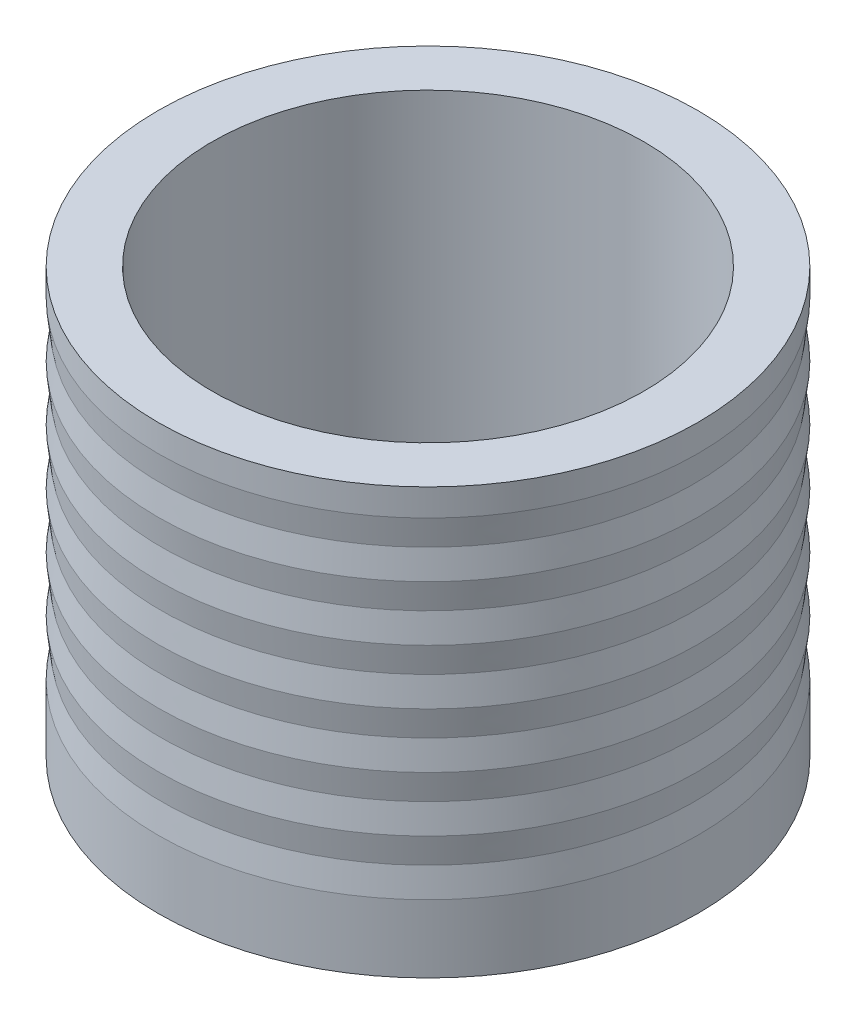
ISO-10303-21;
HEADER;
FILE_DESCRIPTION(('STEP AP214'),'2;1');
FILE_NAME('part.step','',(''),(''),'','','');
FILE_SCHEMA(('AUTOMOTIVE_DESIGN { 1 0 10303 214 1 1 1 1 }'));
ENDSEC;
DATA;
#1=APPLICATION_CONTEXT('core data for automotive mechanical design processes');
#2=APPLICATION_PROTOCOL_DEFINITION('international standard','automotive_design',2000,#1);
#3=PRODUCT_CONTEXT('',#1,'mechanical');
#4=PRODUCT('Part','Part','',(#3));
#5=PRODUCT_RELATED_PRODUCT_CATEGORY('part','',(#4));
#6=PRODUCT_DEFINITION_FORMATION('','',#4);
#7=PRODUCT_DEFINITION_CONTEXT('part definition',#1,'design');
#8=PRODUCT_DEFINITION('design','',#6,#7);
#9=PRODUCT_DEFINITION_SHAPE('','',#8);
#10=(LENGTH_UNIT() NAMED_UNIT(*) SI_UNIT(.MILLI.,.METRE.));
#11=(NAMED_UNIT(*) PLANE_ANGLE_UNIT() SI_UNIT($,.RADIAN.));
#12=(NAMED_UNIT(*) SI_UNIT($,.STERADIAN.) SOLID_ANGLE_UNIT());
#13=UNCERTAINTY_MEASURE_WITH_UNIT(LENGTH_MEASURE(1.E-05),#10,'distance_accuracy_value','');
#14=(GEOMETRIC_REPRESENTATION_CONTEXT(3) GLOBAL_UNCERTAINTY_ASSIGNED_CONTEXT((#13)) GLOBAL_UNIT_ASSIGNED_CONTEXT((#10,
#11,#12)) REPRESENTATION_CONTEXT('',''));
#15=CARTESIAN_POINT('',(0.,0.,0.));
#16=DIRECTION('',(0.,0.,1.));
#17=DIRECTION('',(1.,0.,0.));
#18=AXIS2_PLACEMENT_3D('',#15,#16,#17);
#19=CARTESIAN_POINT('',(0.,-40.6565698055981,0.));
#20=DIRECTION('',(0.,-1.,0.));
#21=DIRECTION('',(0.,0.,-1.));
#22=AXIS2_PLACEMENT_3D('',#19,#20,#21);
#23=CYLINDRICAL_SURFACE('',#22,31.75);
#24=CARTESIAN_POINT('',(0.,46.83125,0.));
#25=DIRECTION('',(0.,-1.,0.));
#26=DIRECTION('',(0.,0.,-1.));
#27=AXIS2_PLACEMENT_3D('',#24,#25,#26);
#28=CIRCLE('',#27,31.75);
#29=CARTESIAN_POINT('',(0.,46.83125,-31.75));
#30=VERTEX_POINT('',#29);
#31=EDGE_CURVE('E53',#30,#30,#28,.T.);
#32=ORIENTED_EDGE('',*,*,#31,.F.);
#33=EDGE_LOOP('',(#32));
#34=FACE_BOUND('',#33,.T.);
#35=CARTESIAN_POINT('',(0.,50.00625,0.));
#36=DIRECTION('',(0.,-1.,0.));
#37=DIRECTION('',(0.,0.,-1.));
#38=AXIS2_PLACEMENT_3D('',#35,#36,#37);
#39=CIRCLE('',#38,31.75);
#40=CARTESIAN_POINT('',(0.,50.00625,-31.75));
#41=VERTEX_POINT('',#40);
#42=EDGE_CURVE('E40',#41,#41,#39,.T.);
#43=ORIENTED_EDGE('',*,*,#42,.T.);
#44=EDGE_LOOP('',(#43));
#45=FACE_BOUND('',#44,.T.);
#46=ADVANCED_FACE('F33',(#34,#45),#23,.T.);
#47=CARTESIAN_POINT('',(0.,0.,0.));
#48=DIRECTION('',(0.,1.,0.));
#49=DIRECTION('',(0.,0.,1.));
#50=AXIS2_PLACEMENT_3D('',#47,#48,#49);
#51=PLANE('',#50);
#52=CARTESIAN_POINT('',(0.,0.,0.));
#53=DIRECTION('',(0.,-1.,0.));
#54=DIRECTION('',(0.,0.,-1.));
#55=AXIS2_PLACEMENT_3D('',#52,#53,#54);
#56=CIRCLE('',#55,25.4);
#57=CARTESIAN_POINT('',(0.,0.,-25.4));
#58=VERTEX_POINT('',#57);
#59=EDGE_CURVE('E48',#58,#58,#56,.T.);
#60=ORIENTED_EDGE('',*,*,#59,.F.);
#61=EDGE_LOOP('',(#60));
#62=FACE_BOUND('',#61,.T.);
#63=CARTESIAN_POINT('',(0.,0.,0.));
#64=DIRECTION('',(0.,-1.,0.));
#65=DIRECTION('',(0.,0.,-1.));
#66=AXIS2_PLACEMENT_3D('',#63,#64,#65);
#67=CIRCLE('',#66,31.75);
#68=CARTESIAN_POINT('',(0.,0.,-31.75));
#69=VERTEX_POINT('',#68);
#70=EDGE_CURVE('E10',#69,#69,#67,.T.);
#71=ORIENTED_EDGE('',*,*,#70,.T.);
#72=EDGE_LOOP('',(#71));
#73=FACE_BOUND('',#72,.T.);
#74=ADVANCED_FACE('F35',(#62,#73),#51,.F.);
#75=CARTESIAN_POINT('',(0.,7.96925,0.));
#76=DIRECTION('',(0.,-1.,0.));
#77=DIRECTION('',(0.,0.,-1.));
#78=AXIS2_PLACEMENT_3D('',#75,#76,#77);
#79=CIRCLE('',#78,31.75);
#80=CARTESIAN_POINT('',(0.,7.96925,-31.75));
#81=VERTEX_POINT('',#80);
#82=EDGE_CURVE('E89',#81,#81,#79,.T.);
#83=ORIENTED_EDGE('',*,*,#82,.T.);
#84=EDGE_LOOP('',(#83));
#85=FACE_BOUND('',#84,.T.);
#86=ORIENTED_EDGE('',*,*,#70,.F.);
#87=EDGE_LOOP('',(#86));
#88=FACE_BOUND('',#87,.T.);
#89=ADVANCED_FACE('F93',(#85,#88),#23,.T.);
#90=CARTESIAN_POINT('',(0.,50.00625,0.));
#91=DIRECTION('',(0.,-1.,0.));
#92=DIRECTION('',(0.,0.,-1.));
#93=AXIS2_PLACEMENT_3D('',#90,#91,#92);
#94=PLANE('',#93);
#95=ORIENTED_EDGE('',*,*,#42,.F.);
#96=EDGE_LOOP('',(#95));
#97=FACE_BOUND('',#96,.T.);
#98=CARTESIAN_POINT('',(0.,50.00625,0.));
#99=DIRECTION('',(0.,-1.,0.));
#100=DIRECTION('',(0.,0.,-1.));
#101=AXIS2_PLACEMENT_3D('',#98,#99,#100);
#102=CIRCLE('',#101,25.4);
#103=CARTESIAN_POINT('',(0.,50.00625,-25.4));
#104=VERTEX_POINT('',#103);
#105=EDGE_CURVE('E44',#104,#104,#102,.T.);
#106=ORIENTED_EDGE('',*,*,#105,.T.);
#107=EDGE_LOOP('',(#106));
#108=FACE_BOUND('',#107,.T.);
#109=ADVANCED_FACE('F176',(#97,#108),#94,.F.);
#110=CARTESIAN_POINT('',(0.,-40.6565698055981,0.));
#111=DIRECTION('',(0.,-1.,0.));
#112=DIRECTION('',(0.,0.,-1.));
#113=AXIS2_PLACEMENT_3D('',#110,#111,#112);
#114=CYLINDRICAL_SURFACE('',#113,25.4);
#115=ORIENTED_EDGE('',*,*,#105,.F.);
#116=EDGE_LOOP('',(#115));
#117=FACE_BOUND('',#116,.T.);
#118=ORIENTED_EDGE('',*,*,#59,.T.);
#119=EDGE_LOOP('',(#118));
#120=FACE_BOUND('',#119,.T.);
#121=ADVANCED_FACE('F165',(#117,#120),#114,.F.);
#122=CARTESIAN_POINT('',(0.,46.83125,0.));
#123=DIRECTION('',(0.,1.,0.));
#124=DIRECTION('',(0.,0.,1.));
#125=AXIS2_PLACEMENT_3D('',#122,#123,#124);
#126=CONICAL_SURFACE('',#125,31.75,0.117108744566864);
#127=CARTESIAN_POINT('',(0.,43.59275,0.));
#128=DIRECTION('',(0.,-1.,0.));
#129=DIRECTION('',(0.,0.,-1.));
#130=AXIS2_PLACEMENT_3D('',#127,#128,#129);
#131=CIRCLE('',#130,31.369);
#132=CARTESIAN_POINT('',(0.,43.59275,-31.369));
#133=VERTEX_POINT('',#132);
#134=EDGE_CURVE('E56',#133,#133,#131,.T.);
#135=ORIENTED_EDGE('',*,*,#134,.F.);
#136=EDGE_LOOP('',(#135));
#137=FACE_BOUND('',#136,.T.);
#138=ORIENTED_EDGE('',*,*,#31,.T.);
#139=EDGE_LOOP('',(#138));
#140=FACE_BOUND('',#139,.T.);
#141=ADVANCED_FACE('F159',(#137,#140),#126,.T.);
#142=CARTESIAN_POINT('',(0.,43.59275,0.));
#143=DIRECTION('',(0.,-1.,0.));
#144=DIRECTION('',(0.,0.,-1.));
#145=AXIS2_PLACEMENT_3D('',#142,#143,#144);
#146=CONICAL_SURFACE('',#145,31.369,0.117108744566864);
#147=CARTESIAN_POINT('',(0.,40.35425,0.));
#148=DIRECTION('',(0.,-1.,0.));
#149=DIRECTION('',(0.,0.,-1.));
#150=AXIS2_PLACEMENT_3D('',#147,#148,#149);
#151=CIRCLE('',#150,31.75);
#152=CARTESIAN_POINT('',(0.,40.35425,-31.75));
#153=VERTEX_POINT('',#152);
#154=EDGE_CURVE('E59',#153,#153,#151,.T.);
#155=ORIENTED_EDGE('',*,*,#154,.F.);
#156=EDGE_LOOP('',(#155));
#157=FACE_BOUND('',#156,.T.);
#158=ORIENTED_EDGE('',*,*,#134,.T.);
#159=EDGE_LOOP('',(#158));
#160=FACE_BOUND('',#159,.T.);
#161=ADVANCED_FACE('F153',(#157,#160),#146,.T.);
#162=CARTESIAN_POINT('',(0.,40.35425,0.));
#163=DIRECTION('',(0.,1.,0.));
#164=DIRECTION('',(0.,0.,1.));
#165=AXIS2_PLACEMENT_3D('',#162,#163,#164);
#166=CONICAL_SURFACE('',#165,31.75,0.117108744566864);
#167=CARTESIAN_POINT('',(0.,37.11575,0.));
#168=DIRECTION('',(0.,-1.,0.));
#169=DIRECTION('',(0.,0.,-1.));
#170=AXIS2_PLACEMENT_3D('',#167,#168,#169);
#171=CIRCLE('',#170,31.369);
#172=CARTESIAN_POINT('',(0.,37.11575,-31.369));
#173=VERTEX_POINT('',#172);
#174=EDGE_CURVE('E62',#173,#173,#171,.T.);
#175=ORIENTED_EDGE('',*,*,#174,.F.);
#176=EDGE_LOOP('',(#175));
#177=FACE_BOUND('',#176,.T.);
#178=ORIENTED_EDGE('',*,*,#154,.T.);
#179=EDGE_LOOP('',(#178));
#180=FACE_BOUND('',#179,.T.);
#181=ADVANCED_FACE('F147',(#177,#180),#166,.T.);
#182=CARTESIAN_POINT('',(0.,37.11575,0.));
#183=DIRECTION('',(0.,-1.,0.));
#184=DIRECTION('',(0.,0.,-1.));
#185=AXIS2_PLACEMENT_3D('',#182,#183,#184);
#186=CONICAL_SURFACE('',#185,31.369,0.117108744566864);
#187=CARTESIAN_POINT('',(0.,33.87725,0.));
#188=DIRECTION('',(0.,-1.,0.));
#189=DIRECTION('',(0.,0.,-1.));
#190=AXIS2_PLACEMENT_3D('',#187,#188,#189);
#191=CIRCLE('',#190,31.75);
#192=CARTESIAN_POINT('',(0.,33.87725,-31.75));
#193=VERTEX_POINT('',#192);
#194=EDGE_CURVE('E65',#193,#193,#191,.T.);
#195=ORIENTED_EDGE('',*,*,#194,.F.);
#196=EDGE_LOOP('',(#195));
#197=FACE_BOUND('',#196,.T.);
#198=ORIENTED_EDGE('',*,*,#174,.T.);
#199=EDGE_LOOP('',(#198));
#200=FACE_BOUND('',#199,.T.);
#201=ADVANCED_FACE('F141',(#197,#200),#186,.T.);
#202=CARTESIAN_POINT('',(0.,33.87725,0.));
#203=DIRECTION('',(0.,1.,0.));
#204=DIRECTION('',(0.,0.,1.));
#205=AXIS2_PLACEMENT_3D('',#202,#203,#204);
#206=CONICAL_SURFACE('',#205,31.75,0.117108744566864);
#207=CARTESIAN_POINT('',(0.,30.63875,0.));
#208=DIRECTION('',(0.,-1.,0.));
#209=DIRECTION('',(0.,0.,-1.));
#210=AXIS2_PLACEMENT_3D('',#207,#208,#209);
#211=CIRCLE('',#210,31.369);
#212=CARTESIAN_POINT('',(0.,30.63875,-31.369));
#213=VERTEX_POINT('',#212);
#214=EDGE_CURVE('E68',#213,#213,#211,.T.);
#215=ORIENTED_EDGE('',*,*,#214,.F.);
#216=EDGE_LOOP('',(#215));
#217=FACE_BOUND('',#216,.T.);
#218=ORIENTED_EDGE('',*,*,#194,.T.);
#219=EDGE_LOOP('',(#218));
#220=FACE_BOUND('',#219,.T.);
#221=ADVANCED_FACE('F135',(#217,#220),#206,.T.);
#222=CARTESIAN_POINT('',(0.,30.63875,0.));
#223=DIRECTION('',(0.,-1.,0.));
#224=DIRECTION('',(0.,0.,-1.));
#225=AXIS2_PLACEMENT_3D('',#222,#223,#224);
#226=CONICAL_SURFACE('',#225,31.369,0.117108744566864);
#227=CARTESIAN_POINT('',(0.,27.40025,0.));
#228=DIRECTION('',(0.,-1.,0.));
#229=DIRECTION('',(0.,0.,-1.));
#230=AXIS2_PLACEMENT_3D('',#227,#228,#229);
#231=CIRCLE('',#230,31.75);
#232=CARTESIAN_POINT('',(0.,27.40025,-31.75));
#233=VERTEX_POINT('',#232);
#234=EDGE_CURVE('E71',#233,#233,#231,.T.);
#235=ORIENTED_EDGE('',*,*,#234,.F.);
#236=EDGE_LOOP('',(#235));
#237=FACE_BOUND('',#236,.T.);
#238=ORIENTED_EDGE('',*,*,#214,.T.);
#239=EDGE_LOOP('',(#238));
#240=FACE_BOUND('',#239,.T.);
#241=ADVANCED_FACE('F129',(#237,#240),#226,.T.);
#242=CARTESIAN_POINT('',(0.,27.40025,0.));
#243=DIRECTION('',(0.,1.,0.));
#244=DIRECTION('',(0.,0.,1.));
#245=AXIS2_PLACEMENT_3D('',#242,#243,#244);
#246=CONICAL_SURFACE('',#245,31.75,0.117108744566864);
#247=CARTESIAN_POINT('',(0.,24.16175,0.));
#248=DIRECTION('',(0.,-1.,0.));
#249=DIRECTION('',(0.,0.,-1.));
#250=AXIS2_PLACEMENT_3D('',#247,#248,#249);
#251=CIRCLE('',#250,31.369);
#252=CARTESIAN_POINT('',(0.,24.16175,-31.369));
#253=VERTEX_POINT('',#252);
#254=EDGE_CURVE('E74',#253,#253,#251,.T.);
#255=ORIENTED_EDGE('',*,*,#254,.F.);
#256=EDGE_LOOP('',(#255));
#257=FACE_BOUND('',#256,.T.);
#258=ORIENTED_EDGE('',*,*,#234,.T.);
#259=EDGE_LOOP('',(#258));
#260=FACE_BOUND('',#259,.T.);
#261=ADVANCED_FACE('F123',(#257,#260),#246,.T.);
#262=CARTESIAN_POINT('',(0.,24.16175,0.));
#263=DIRECTION('',(0.,-1.,0.));
#264=DIRECTION('',(0.,0.,-1.));
#265=AXIS2_PLACEMENT_3D('',#262,#263,#264);
#266=CONICAL_SURFACE('',#265,31.369,0.117108744566864);
#267=CARTESIAN_POINT('',(0.,20.92325,0.));
#268=DIRECTION('',(0.,-1.,0.));
#269=DIRECTION('',(0.,0.,-1.));
#270=AXIS2_PLACEMENT_3D('',#267,#268,#269);
#271=CIRCLE('',#270,31.75);
#272=CARTESIAN_POINT('',(0.,20.92325,-31.75));
#273=VERTEX_POINT('',#272);
#274=EDGE_CURVE('E77',#273,#273,#271,.T.);
#275=ORIENTED_EDGE('',*,*,#274,.F.);
#276=EDGE_LOOP('',(#275));
#277=FACE_BOUND('',#276,.T.);
#278=ORIENTED_EDGE('',*,*,#254,.T.);
#279=EDGE_LOOP('',(#278));
#280=FACE_BOUND('',#279,.T.);
#281=ADVANCED_FACE('F117',(#277,#280),#266,.T.);
#282=CARTESIAN_POINT('',(0.,20.92325,0.));
#283=DIRECTION('',(0.,1.,0.));
#284=DIRECTION('',(0.,0.,1.));
#285=AXIS2_PLACEMENT_3D('',#282,#283,#284);
#286=CONICAL_SURFACE('',#285,31.75,0.117108744566864);
#287=CARTESIAN_POINT('',(0.,17.68475,0.));
#288=DIRECTION('',(0.,-1.,0.));
#289=DIRECTION('',(0.,0.,-1.));
#290=AXIS2_PLACEMENT_3D('',#287,#288,#289);
#291=CIRCLE('',#290,31.369);
#292=CARTESIAN_POINT('',(0.,17.68475,-31.369));
#293=VERTEX_POINT('',#292);
#294=EDGE_CURVE('E80',#293,#293,#291,.T.);
#295=ORIENTED_EDGE('',*,*,#294,.F.);
#296=EDGE_LOOP('',(#295));
#297=FACE_BOUND('',#296,.T.);
#298=ORIENTED_EDGE('',*,*,#274,.T.);
#299=EDGE_LOOP('',(#298));
#300=FACE_BOUND('',#299,.T.);
#301=ADVANCED_FACE('F111',(#297,#300),#286,.T.);
#302=CARTESIAN_POINT('',(0.,17.68475,0.));
#303=DIRECTION('',(0.,-1.,0.));
#304=DIRECTION('',(0.,0.,-1.));
#305=AXIS2_PLACEMENT_3D('',#302,#303,#304);
#306=CONICAL_SURFACE('',#305,31.369,0.117108744566864);
#307=CARTESIAN_POINT('',(0.,14.44625,0.));
#308=DIRECTION('',(0.,-1.,0.));
#309=DIRECTION('',(0.,0.,-1.));
#310=AXIS2_PLACEMENT_3D('',#307,#308,#309);
#311=CIRCLE('',#310,31.75);
#312=CARTESIAN_POINT('',(0.,14.44625,-31.75));
#313=VERTEX_POINT('',#312);
#314=EDGE_CURVE('E83',#313,#313,#311,.T.);
#315=ORIENTED_EDGE('',*,*,#314,.F.);
#316=EDGE_LOOP('',(#315));
#317=FACE_BOUND('',#316,.T.);
#318=ORIENTED_EDGE('',*,*,#294,.T.);
#319=EDGE_LOOP('',(#318));
#320=FACE_BOUND('',#319,.T.);
#321=ADVANCED_FACE('F105',(#317,#320),#306,.T.);
#322=CARTESIAN_POINT('',(0.,14.44625,0.));
#323=DIRECTION('',(0.,1.,0.));
#324=DIRECTION('',(0.,0.,1.));
#325=AXIS2_PLACEMENT_3D('',#322,#323,#324);
#326=CONICAL_SURFACE('',#325,31.75,0.117108744566864);
#327=CARTESIAN_POINT('',(0.,11.20775,0.));
#328=DIRECTION('',(0.,-1.,0.));
#329=DIRECTION('',(0.,0.,-1.));
#330=AXIS2_PLACEMENT_3D('',#327,#328,#329);
#331=CIRCLE('',#330,31.369);
#332=CARTESIAN_POINT('',(0.,11.20775,-31.369));
#333=VERTEX_POINT('',#332);
#334=EDGE_CURVE('E86',#333,#333,#331,.T.);
#335=ORIENTED_EDGE('',*,*,#334,.F.);
#336=EDGE_LOOP('',(#335));
#337=FACE_BOUND('',#336,.T.);
#338=ORIENTED_EDGE('',*,*,#314,.T.);
#339=EDGE_LOOP('',(#338));
#340=FACE_BOUND('',#339,.T.);
#341=ADVANCED_FACE('F99',(#337,#340),#326,.T.);
#342=CARTESIAN_POINT('',(0.,11.20775,0.));
#343=DIRECTION('',(0.,-1.,0.));
#344=DIRECTION('',(0.,0.,-1.));
#345=AXIS2_PLACEMENT_3D('',#342,#343,#344);
#346=CONICAL_SURFACE('',#345,31.369,0.117108744566864);
#347=ORIENTED_EDGE('',*,*,#82,.F.);
#348=EDGE_LOOP('',(#347));
#349=FACE_BOUND('',#348,.T.);
#350=ORIENTED_EDGE('',*,*,#334,.T.);
#351=EDGE_LOOP('',(#350));
#352=FACE_BOUND('',#351,.T.);
#353=ADVANCED_FACE('F96',(#349,#352),#346,.T.);
#354=CLOSED_SHELL('',(#46,#74,#89,#109,#121,#141,#161,#181,#201,#221,#241,#261,#281,#301,#321,
#341,#353));
#355=MANIFOLD_SOLID_BREP('B2',#354);
#356=ADVANCED_BREP_SHAPE_REPRESENTATION('',(#18,#355),#14);
#357=SHAPE_DEFINITION_REPRESENTATION(#9,#356);
ENDSEC;
END-ISO-10303-21;
